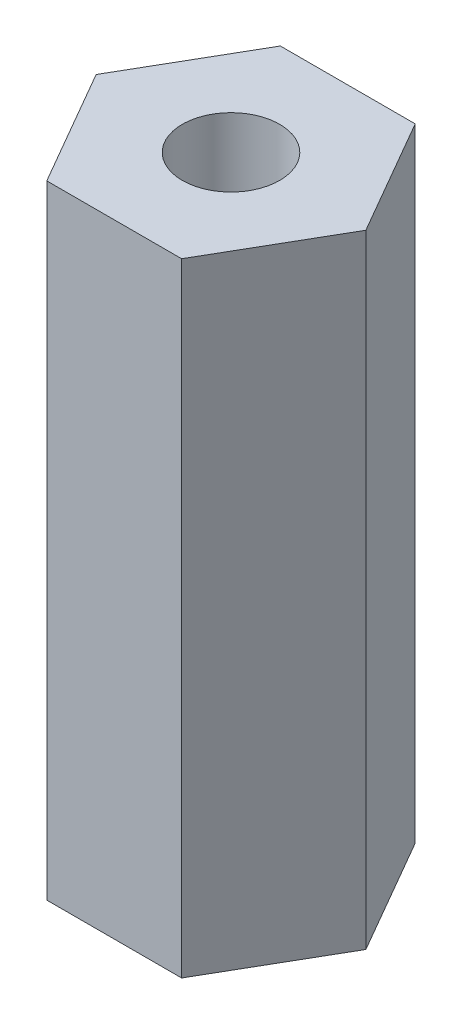
ISO-10303-21;
HEADER;
FILE_DESCRIPTION(('STEP AP214'),'2;1');
FILE_NAME('part.step','',(''),(''),'','','');
FILE_SCHEMA(('AUTOMOTIVE_DESIGN { 1 0 10303 214 1 1 1 1 }'));
ENDSEC;
DATA;
#1=APPLICATION_CONTEXT('core data for automotive mechanical design processes');
#2=APPLICATION_PROTOCOL_DEFINITION('international standard','automotive_design',2000,#1);
#3=PRODUCT_CONTEXT('',#1,'mechanical');
#4=PRODUCT('Part','Part','',(#3));
#5=PRODUCT_RELATED_PRODUCT_CATEGORY('part','',(#4));
#6=PRODUCT_DEFINITION_FORMATION('','',#4);
#7=PRODUCT_DEFINITION_CONTEXT('part definition',#1,'design');
#8=PRODUCT_DEFINITION('design','',#6,#7);
#9=PRODUCT_DEFINITION_SHAPE('','',#8);
#10=(LENGTH_UNIT() NAMED_UNIT(*) SI_UNIT(.MILLI.,.METRE.));
#11=(NAMED_UNIT(*) PLANE_ANGLE_UNIT() SI_UNIT($,.RADIAN.));
#12=(NAMED_UNIT(*) SI_UNIT($,.STERADIAN.) SOLID_ANGLE_UNIT());
#13=UNCERTAINTY_MEASURE_WITH_UNIT(LENGTH_MEASURE(1.E-05),#10,'distance_accuracy_value','');
#14=(GEOMETRIC_REPRESENTATION_CONTEXT(3) GLOBAL_UNCERTAINTY_ASSIGNED_CONTEXT((#13)) GLOBAL_UNIT_ASSIGNED_CONTEXT((#10,
#11,#12)) REPRESENTATION_CONTEXT('',''));
#15=CARTESIAN_POINT('',(0.,0.,0.));
#16=DIRECTION('',(0.,0.,1.));
#17=DIRECTION('',(1.,0.,0.));
#18=AXIS2_PLACEMENT_3D('',#15,#16,#17);
#19=CARTESIAN_POINT('',(3.46410161513775,16.,0.));
#20=DIRECTION('',(-0.866025403784438,0.,0.5));
#21=DIRECTION('',(0.5,0.,0.866025403784439));
#22=AXIS2_PLACEMENT_3D('',#19,#20,#21);
#23=PLANE('',#22);
#24=DIRECTION('',(-0.5,0.,-0.866025403784438));
#25=VECTOR('',#24,1.);
#26=CARTESIAN_POINT('',(3.46410161513775,0.,0.));
#27=LINE('',#26,#25);
#28=CARTESIAN_POINT('',(3.46410161513775,0.,0.));
#29=VERTEX_POINT('',#28);
#30=CARTESIAN_POINT('',(1.73205080756888,0.,-3.));
#31=VERTEX_POINT('',#30);
#32=EDGE_CURVE('E119',#29,#31,#27,.T.);
#33=ORIENTED_EDGE('',*,*,#32,.T.);
#34=DIRECTION('',(0.,-1.,0.));
#35=VECTOR('',#34,1.);
#36=CARTESIAN_POINT('',(1.73205080756888,16.,-3.));
#37=LINE('',#36,#35);
#38=CARTESIAN_POINT('',(1.73205080756888,16.,-3.));
#39=VERTEX_POINT('',#38);
#40=EDGE_CURVE('E11',#39,#31,#37,.T.);
#41=ORIENTED_EDGE('',*,*,#40,.F.);
#42=DIRECTION('',(-0.5,0.,-0.866025403784438));
#43=VECTOR('',#42,1.);
#44=CARTESIAN_POINT('',(3.46410161513775,16.,0.));
#45=LINE('',#44,#43);
#46=CARTESIAN_POINT('',(3.46410161513775,16.,0.));
#47=VERTEX_POINT('',#46);
#48=EDGE_CURVE('E130',#47,#39,#45,.T.);
#49=ORIENTED_EDGE('',*,*,#48,.F.);
#50=DIRECTION('',(0.,-1.,0.));
#51=VECTOR('',#50,1.);
#52=CARTESIAN_POINT('',(3.46410161513775,16.,0.));
#53=LINE('',#52,#51);
#54=EDGE_CURVE('E115',#47,#29,#53,.T.);
#55=ORIENTED_EDGE('',*,*,#54,.T.);
#56=EDGE_LOOP('',(#33,#41,#49,#55));
#57=FACE_BOUND('',#56,.T.);
#58=ADVANCED_FACE('F35',(#57),#23,.F.);
#59=CARTESIAN_POINT('',(1.73205080756888,16.,-3.));
#60=DIRECTION('',(0.,0.,1.));
#61=DIRECTION('',(1.,0.,0.));
#62=AXIS2_PLACEMENT_3D('',#59,#60,#61);
#63=PLANE('',#62);
#64=DIRECTION('',(-1.,0.,0.));
#65=VECTOR('',#64,1.);
#66=CARTESIAN_POINT('',(1.73205080756888,0.,-3.));
#67=LINE('',#66,#65);
#68=CARTESIAN_POINT('',(-1.73205080756888,0.,-3.));
#69=VERTEX_POINT('',#68);
#70=EDGE_CURVE('E122',#31,#69,#67,.T.);
#71=ORIENTED_EDGE('',*,*,#70,.T.);
#72=DIRECTION('',(0.,-1.,0.));
#73=VECTOR('',#72,1.);
#74=CARTESIAN_POINT('',(-1.73205080756888,16.,-3.));
#75=LINE('',#74,#73);
#76=CARTESIAN_POINT('',(-1.73205080756888,16.,-3.));
#77=VERTEX_POINT('',#76);
#78=EDGE_CURVE('E43',#77,#69,#75,.T.);
#79=ORIENTED_EDGE('',*,*,#78,.F.);
#80=DIRECTION('',(-1.,0.,0.));
#81=VECTOR('',#80,1.);
#82=CARTESIAN_POINT('',(1.73205080756888,16.,-3.));
#83=LINE('',#82,#81);
#84=EDGE_CURVE('E88',#39,#77,#83,.T.);
#85=ORIENTED_EDGE('',*,*,#84,.F.);
#86=ORIENTED_EDGE('',*,*,#40,.T.);
#87=EDGE_LOOP('',(#71,#79,#85,#86));
#88=FACE_BOUND('',#87,.T.);
#89=ADVANCED_FACE('F155',(#88),#63,.F.);
#90=CARTESIAN_POINT('',(-1.73205080756888,16.,-3.));
#91=DIRECTION('',(0.866025403784439,0.,0.5));
#92=DIRECTION('',(0.5,0.,-0.866025403784439));
#93=AXIS2_PLACEMENT_3D('',#90,#91,#92);
#94=PLANE('',#93);
#95=DIRECTION('',(-0.5,0.,0.866025403784439));
#96=VECTOR('',#95,1.);
#97=CARTESIAN_POINT('',(-1.73205080756888,0.,-3.));
#98=LINE('',#97,#96);
#99=CARTESIAN_POINT('',(-3.46410161513775,0.,0.));
#100=VERTEX_POINT('',#99);
#101=EDGE_CURVE('E125',#69,#100,#98,.T.);
#102=ORIENTED_EDGE('',*,*,#101,.T.);
#103=DIRECTION('',(0.,-1.,0.));
#104=VECTOR('',#103,1.);
#105=CARTESIAN_POINT('',(-3.46410161513775,16.,0.));
#106=LINE('',#105,#104);
#107=CARTESIAN_POINT('',(-3.46410161513775,16.,0.));
#108=VERTEX_POINT('',#107);
#109=EDGE_CURVE('E110',#108,#100,#106,.T.);
#110=ORIENTED_EDGE('',*,*,#109,.F.);
#111=DIRECTION('',(-0.5,0.,0.866025403784439));
#112=VECTOR('',#111,1.);
#113=CARTESIAN_POINT('',(-1.73205080756888,16.,-3.));
#114=LINE('',#113,#112);
#115=EDGE_CURVE('E101',#77,#108,#114,.T.);
#116=ORIENTED_EDGE('',*,*,#115,.F.);
#117=ORIENTED_EDGE('',*,*,#78,.T.);
#118=EDGE_LOOP('',(#102,#110,#116,#117));
#119=FACE_BOUND('',#118,.T.);
#120=ADVANCED_FACE('F136',(#119),#94,.F.);
#121=CARTESIAN_POINT('',(-3.46410161513775,16.,0.));
#122=DIRECTION('',(0.866025403784439,0.,-0.5));
#123=DIRECTION('',(-0.5,0.,-0.866025403784438));
#124=AXIS2_PLACEMENT_3D('',#121,#122,#123);
#125=PLANE('',#124);
#126=DIRECTION('',(0.5,0.,0.866025403784438));
#127=VECTOR('',#126,1.);
#128=CARTESIAN_POINT('',(-3.46410161513775,0.,0.));
#129=LINE('',#128,#127);
#130=CARTESIAN_POINT('',(-1.73205080756888,0.,3.));
#131=VERTEX_POINT('',#130);
#132=EDGE_CURVE('E109',#100,#131,#129,.T.);
#133=ORIENTED_EDGE('',*,*,#132,.T.);
#134=DIRECTION('',(0.,-1.,0.));
#135=VECTOR('',#134,1.);
#136=CARTESIAN_POINT('',(-1.73205080756888,16.,3.));
#137=LINE('',#136,#135);
#138=CARTESIAN_POINT('',(-1.73205080756888,16.,3.));
#139=VERTEX_POINT('',#138);
#140=EDGE_CURVE('E106',#139,#131,#137,.T.);
#141=ORIENTED_EDGE('',*,*,#140,.F.);
#142=DIRECTION('',(0.5,0.,0.866025403784438));
#143=VECTOR('',#142,1.);
#144=CARTESIAN_POINT('',(-3.46410161513775,16.,0.));
#145=LINE('',#144,#143);
#146=EDGE_CURVE('E95',#108,#139,#145,.T.);
#147=ORIENTED_EDGE('',*,*,#146,.F.);
#148=ORIENTED_EDGE('',*,*,#109,.T.);
#149=EDGE_LOOP('',(#133,#141,#147,#148));
#150=FACE_BOUND('',#149,.T.);
#151=ADVANCED_FACE('F107',(#150),#125,.F.);
#152=CARTESIAN_POINT('',(-1.73205080756888,16.,3.));
#153=DIRECTION('',(0.,0.,-1.));
#154=DIRECTION('',(-1.,0.,0.));
#155=AXIS2_PLACEMENT_3D('',#152,#153,#154);
#156=PLANE('',#155);
#157=DIRECTION('',(1.,0.,0.));
#158=VECTOR('',#157,1.);
#159=CARTESIAN_POINT('',(-1.73205080756888,0.,3.));
#160=LINE('',#159,#158);
#161=CARTESIAN_POINT('',(1.73205080756888,0.,3.));
#162=VERTEX_POINT('',#161);
#163=EDGE_CURVE('E74',#131,#162,#160,.T.);
#164=ORIENTED_EDGE('',*,*,#163,.T.);
#165=DIRECTION('',(0.,-1.,0.));
#166=VECTOR('',#165,1.);
#167=CARTESIAN_POINT('',(1.73205080756888,16.,3.));
#168=LINE('',#167,#166);
#169=CARTESIAN_POINT('',(1.73205080756888,16.,3.));
#170=VERTEX_POINT('',#169);
#171=EDGE_CURVE('E111',#170,#162,#168,.T.);
#172=ORIENTED_EDGE('',*,*,#171,.F.);
#173=DIRECTION('',(1.,0.,0.));
#174=VECTOR('',#173,1.);
#175=CARTESIAN_POINT('',(-1.73205080756888,16.,3.));
#176=LINE('',#175,#174);
#177=EDGE_CURVE('E99',#139,#170,#176,.T.);
#178=ORIENTED_EDGE('',*,*,#177,.F.);
#179=ORIENTED_EDGE('',*,*,#140,.T.);
#180=EDGE_LOOP('',(#164,#172,#178,#179));
#181=FACE_BOUND('',#180,.T.);
#182=ADVANCED_FACE('F113',(#181),#156,.F.);
#183=CARTESIAN_POINT('',(1.73205080756888,16.,3.));
#184=DIRECTION('',(-0.866025403784439,0.,-0.5));
#185=DIRECTION('',(-0.5,0.,0.866025403784439));
#186=AXIS2_PLACEMENT_3D('',#183,#184,#185);
#187=PLANE('',#186);
#188=DIRECTION('',(0.5,0.,-0.866025403784438));
#189=VECTOR('',#188,1.);
#190=CARTESIAN_POINT('',(1.73205080756888,0.,3.));
#191=LINE('',#190,#189);
#192=EDGE_CURVE('E80',#162,#29,#191,.T.);
#193=ORIENTED_EDGE('',*,*,#192,.T.);
#194=ORIENTED_EDGE('',*,*,#54,.F.);
#195=DIRECTION('',(0.5,0.,-0.866025403784438));
#196=VECTOR('',#195,1.);
#197=CARTESIAN_POINT('',(1.73205080756888,16.,3.));
#198=LINE('',#197,#196);
#199=EDGE_CURVE('E51',#170,#47,#198,.T.);
#200=ORIENTED_EDGE('',*,*,#199,.F.);
#201=ORIENTED_EDGE('',*,*,#171,.T.);
#202=EDGE_LOOP('',(#193,#194,#200,#201));
#203=FACE_BOUND('',#202,.T.);
#204=ADVANCED_FACE('F143',(#203),#187,.F.);
#205=CARTESIAN_POINT('',(1.73205080756888,16.,-3.));
#206=DIRECTION('',(0.,1.,0.));
#207=DIRECTION('',(0.,0.,1.));
#208=AXIS2_PLACEMENT_3D('',#205,#206,#207);
#209=PLANE('',#208);
#210=CARTESIAN_POINT('',(0.,16.,0.));
#211=DIRECTION('',(0.,1.,0.));
#212=DIRECTION('',(0.,0.,1.));
#213=AXIS2_PLACEMENT_3D('',#210,#211,#212);
#214=CIRCLE('',#213,1.25);
#215=CARTESIAN_POINT('',(0.,16.,1.25));
#216=VERTEX_POINT('',#215);
#217=EDGE_CURVE('E212',#216,#216,#214,.T.);
#218=ORIENTED_EDGE('',*,*,#217,.F.);
#219=EDGE_LOOP('',(#218));
#220=FACE_BOUND('',#219,.T.);
#221=ORIENTED_EDGE('',*,*,#48,.T.);
#222=ORIENTED_EDGE('',*,*,#84,.T.);
#223=ORIENTED_EDGE('',*,*,#115,.T.);
#224=ORIENTED_EDGE('',*,*,#146,.T.);
#225=ORIENTED_EDGE('',*,*,#177,.T.);
#226=ORIENTED_EDGE('',*,*,#199,.T.);
#227=EDGE_LOOP('',(#221,#222,#223,#224,#225,#226));
#228=FACE_BOUND('',#227,.T.);
#229=ADVANCED_FACE('F97',(#220,#228),#209,.T.);
#230=CARTESIAN_POINT('',(1.73205080756888,0.,-3.));
#231=DIRECTION('',(0.,1.,0.));
#232=DIRECTION('',(0.,0.,1.));
#233=AXIS2_PLACEMENT_3D('',#230,#231,#232);
#234=PLANE('',#233);
#235=CARTESIAN_POINT('',(0.,0.,0.));
#236=DIRECTION('',(0.,1.,0.));
#237=DIRECTION('',(0.,0.,1.));
#238=AXIS2_PLACEMENT_3D('',#235,#236,#237);
#239=CIRCLE('',#238,1.25);
#240=CARTESIAN_POINT('',(0.,0.,1.25));
#241=VERTEX_POINT('',#240);
#242=EDGE_CURVE('E123',#241,#241,#239,.T.);
#243=ORIENTED_EDGE('',*,*,#242,.T.);
#244=EDGE_LOOP('',(#243));
#245=FACE_BOUND('',#244,.T.);
#246=ORIENTED_EDGE('',*,*,#32,.F.);
#247=ORIENTED_EDGE('',*,*,#192,.F.);
#248=ORIENTED_EDGE('',*,*,#163,.F.);
#249=ORIENTED_EDGE('',*,*,#132,.F.);
#250=ORIENTED_EDGE('',*,*,#101,.F.);
#251=ORIENTED_EDGE('',*,*,#70,.F.);
#252=EDGE_LOOP('',(#246,#247,#248,#249,#250,#251));
#253=FACE_BOUND('',#252,.T.);
#254=ADVANCED_FACE('F139',(#245,#253),#234,.F.);
#255=CARTESIAN_POINT('',(0.,16.,0.));
#256=DIRECTION('',(0.,1.,0.));
#257=DIRECTION('',(0.,0.,1.));
#258=AXIS2_PLACEMENT_3D('',#255,#256,#257);
#259=CYLINDRICAL_SURFACE('',#258,1.25);
#260=ORIENTED_EDGE('',*,*,#242,.F.);
#261=EDGE_LOOP('',(#260));
#262=FACE_BOUND('',#261,.T.);
#263=ORIENTED_EDGE('',*,*,#217,.T.);
#264=EDGE_LOOP('',(#263));
#265=FACE_BOUND('',#264,.T.);
#266=ADVANCED_FACE('F192',(#262,#265),#259,.F.);
#267=CLOSED_SHELL('',(#58,#89,#120,#151,#182,#204,#229,#254,#266));
#268=MANIFOLD_SOLID_BREP('B2',#267);
#269=ADVANCED_BREP_SHAPE_REPRESENTATION('',(#18,#268),#14);
#270=SHAPE_DEFINITION_REPRESENTATION(#9,#269);
ENDSEC;
END-ISO-10303-21;
